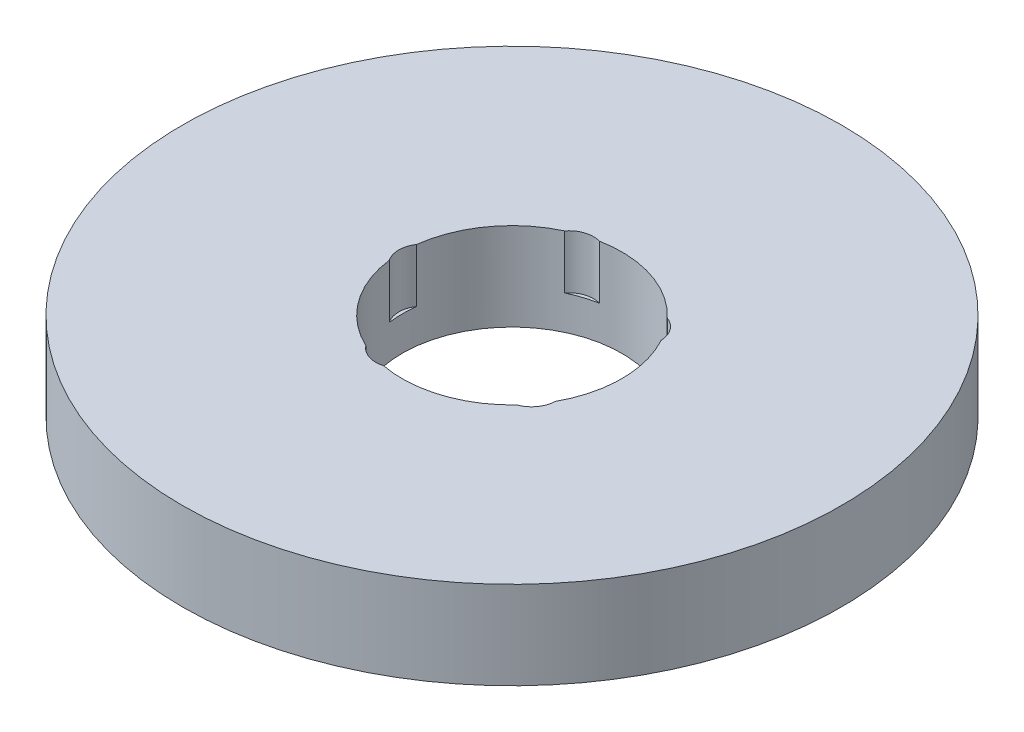
ISO-10303-21;
HEADER;
FILE_DESCRIPTION(('STEP AP214'),'2;1');
FILE_NAME('part.step','',(''),(''),'','','');
FILE_SCHEMA(('AUTOMOTIVE_DESIGN { 1 0 10303 214 1 1 1 1 }'));
ENDSEC;
DATA;
#1=APPLICATION_CONTEXT('core data for automotive mechanical design processes');
#2=APPLICATION_PROTOCOL_DEFINITION('international standard','automotive_design',2000,#1);
#3=PRODUCT_CONTEXT('',#1,'mechanical');
#4=PRODUCT('Part','Part','',(#3));
#5=PRODUCT_RELATED_PRODUCT_CATEGORY('part','',(#4));
#6=PRODUCT_DEFINITION_FORMATION('','',#4);
#7=PRODUCT_DEFINITION_CONTEXT('part definition',#1,'design');
#8=PRODUCT_DEFINITION('design','',#6,#7);
#9=PRODUCT_DEFINITION_SHAPE('','',#8);
#10=(LENGTH_UNIT() NAMED_UNIT(*) SI_UNIT(.MILLI.,.METRE.));
#11=(NAMED_UNIT(*) PLANE_ANGLE_UNIT() SI_UNIT($,.RADIAN.));
#12=(NAMED_UNIT(*) SI_UNIT($,.STERADIAN.) SOLID_ANGLE_UNIT());
#13=UNCERTAINTY_MEASURE_WITH_UNIT(LENGTH_MEASURE(1.E-05),#10,'distance_accuracy_value','');
#14=(GEOMETRIC_REPRESENTATION_CONTEXT(3) GLOBAL_UNCERTAINTY_ASSIGNED_CONTEXT((#13)) GLOBAL_UNIT_ASSIGNED_CONTEXT((#10,
#11,#12)) REPRESENTATION_CONTEXT('',''));
#15=CARTESIAN_POINT('',(0.,0.,0.));
#16=DIRECTION('',(0.,0.,1.));
#17=DIRECTION('',(1.,0.,0.));
#18=AXIS2_PLACEMENT_3D('',#15,#16,#17);
#19=CARTESIAN_POINT('',(0.,16.,0.));
#20=DIRECTION('',(0.,-1.,0.));
#21=DIRECTION('',(0.,0.,-1.));
#22=AXIS2_PLACEMENT_3D('',#19,#20,#21);
#23=CYLINDRICAL_SURFACE('',#22,60.);
#24=CARTESIAN_POINT('',(0.,16.,0.));
#25=DIRECTION('',(0.,1.,0.));
#26=DIRECTION('',(0.,0.,1.));
#27=AXIS2_PLACEMENT_3D('',#24,#25,#26);
#28=CIRCLE('',#27,60.);
#29=CARTESIAN_POINT('',(0.,16.,60.));
#30=VERTEX_POINT('',#29);
#31=EDGE_CURVE('E151',#30,#30,#28,.T.);
#32=ORIENTED_EDGE('',*,*,#31,.F.);
#33=EDGE_LOOP('',(#32));
#34=FACE_BOUND('',#33,.T.);
#35=CARTESIAN_POINT('',(0.,0.,0.));
#36=DIRECTION('',(0.,1.,0.));
#37=DIRECTION('',(0.,0.,1.));
#38=AXIS2_PLACEMENT_3D('',#35,#36,#37);
#39=CIRCLE('',#38,60.);
#40=CARTESIAN_POINT('',(0.,0.,60.));
#41=VERTEX_POINT('',#40);
#42=EDGE_CURVE('E150',#41,#41,#39,.T.);
#43=ORIENTED_EDGE('',*,*,#42,.T.);
#44=EDGE_LOOP('',(#43));
#45=FACE_BOUND('',#44,.T.);
#46=ADVANCED_FACE('F39',(#34,#45),#23,.T.);
#47=CARTESIAN_POINT('',(0.,16.,0.));
#48=DIRECTION('',(0.,1.,0.));
#49=DIRECTION('',(0.,0.,1.));
#50=AXIS2_PLACEMENT_3D('',#47,#48,#49);
#51=PLANE('',#50);
#52=CARTESIAN_POINT('',(-4.99429820584385,16.,-15.3708693678689));
#53=DIRECTION('',(0.,1.,0.));
#54=DIRECTION('',(-0.95105651629515,0.,0.309016994374958));
#55=AXIS2_PLACEMENT_3D('',#52,#53,#54);
#56=CIRCLE('',#55,4.45023562822626);
#57=CARTESIAN_POINT('',(-3.75348993247274,16.,-19.6446255583258));
#58=VERTEX_POINT('',#57);
#59=CARTESIAN_POINT('',(-8.51018404640637,16.,-18.0990819517535));
#60=VERTEX_POINT('',#59);
#61=EDGE_CURVE('E196',#58,#60,#56,.T.);
#62=ORIENTED_EDGE('',*,*,#61,.F.);
#63=CARTESIAN_POINT('',(0.,16.,0.));
#64=DIRECTION('',(0.,1.,0.));
#65=DIRECTION('',(0.,0.,1.));
#66=AXIS2_PLACEMENT_3D('',#63,#64,#65);
#67=CIRCLE('',#66,20.);
#68=CARTESIAN_POINT('',(14.5834583335771,16.,-13.6865898978825));
#69=VERTEX_POINT('',#68);
#70=EDGE_CURVE('E156',#69,#58,#67,.T.);
#71=ORIENTED_EDGE('',*,*,#70,.F.);
#72=CARTESIAN_POINT('',(13.0752424528513,16.,-9.49971970597775));
#73=DIRECTION('',(0.,1.,0.));
#74=DIRECTION('',(-0.58778525229248,0.,-0.809016994374942));
#75=AXIS2_PLACEMENT_3D('',#72,#73,#74);
#76=CIRCLE('',#75,4.45023562822626);
#77=CARTESIAN_POINT('',(17.5232569700747,16.,-9.64030420478151));
#78=VERTEX_POINT('',#77);
#79=EDGE_CURVE('E254',#78,#69,#76,.T.);
#80=ORIENTED_EDGE('',*,*,#79,.F.);
#81=CARTESIAN_POINT('',(17.5232569700749,16.,9.64030420478126));
#82=VERTEX_POINT('',#81);
#83=EDGE_CURVE('E153',#82,#78,#67,.T.);
#84=ORIENTED_EDGE('',*,*,#83,.F.);
#85=CARTESIAN_POINT('',(13.0752424528514,16.,9.49971970597756));
#86=DIRECTION('',(0.,1.,0.));
#87=DIRECTION('',(0.587785252292469,0.,-0.809016994374951));
#88=AXIS2_PLACEMENT_3D('',#85,#86,#87);
#89=CIRCLE('',#88,4.45023562822626);
#90=CARTESIAN_POINT('',(14.5834583335773,16.,13.6865898978823));
#91=VERTEX_POINT('',#90);
#92=EDGE_CURVE('E248',#91,#82,#89,.T.);
#93=ORIENTED_EDGE('',*,*,#92,.F.);
#94=CARTESIAN_POINT('',(-3.75348993247245,16.,19.6446255583258));
#95=VERTEX_POINT('',#94);
#96=EDGE_CURVE('E140',#95,#91,#67,.T.);
#97=ORIENTED_EDGE('',*,*,#96,.F.);
#98=CARTESIAN_POINT('',(-4.99429820584363,16.,15.370869367869));
#99=DIRECTION('',(0.,1.,0.));
#100=DIRECTION('',(0.951056516295155,0.,0.309016994374945));
#101=AXIS2_PLACEMENT_3D('',#98,#99,#100);
#102=CIRCLE('',#101,4.45023562822626);
#103=CARTESIAN_POINT('',(-8.51018404640611,16.,18.0990819517537));
#104=VERTEX_POINT('',#103);
#105=EDGE_CURVE('E117',#104,#95,#102,.T.);
#106=ORIENTED_EDGE('',*,*,#105,.F.);
#107=CARTESIAN_POINT('',(-19.8430413247734,16.,2.50074208652887));
#108=VERTEX_POINT('',#107);
#109=EDGE_CURVE('E133',#108,#104,#67,.T.);
#110=ORIENTED_EDGE('',*,*,#109,.F.);
#111=CARTESIAN_POINT('',(-16.1618884940154,16.,0.));
#112=DIRECTION('',(0.,1.,0.));
#113=DIRECTION('',(0.,0.,1.));
#114=AXIS2_PLACEMENT_3D('',#111,#112,#113);
#115=CIRCLE('',#114,4.45023562822626);
#116=CARTESIAN_POINT('',(-19.8430413247734,16.,-2.50074208652887));
#117=VERTEX_POINT('',#116);
#118=EDGE_CURVE('E170',#117,#108,#115,.T.);
#119=ORIENTED_EDGE('',*,*,#118,.F.);
#120=EDGE_CURVE('E149',#60,#117,#67,.T.);
#121=ORIENTED_EDGE('',*,*,#120,.F.);
#122=EDGE_LOOP('',(#62,#71,#80,#84,#93,#97,#106,#110,#119,#121));
#123=FACE_BOUND('',#122,.T.);
#124=ORIENTED_EDGE('',*,*,#31,.T.);
#125=EDGE_LOOP('',(#124));
#126=FACE_BOUND('',#125,.T.);
#127=ADVANCED_FACE('F131',(#123,#126),#51,.T.);
#128=CARTESIAN_POINT('',(0.,0.,0.));
#129=DIRECTION('',(0.,1.,0.));
#130=DIRECTION('',(0.,0.,1.));
#131=AXIS2_PLACEMENT_3D('',#128,#129,#130);
#132=PLANE('',#131);
#133=CARTESIAN_POINT('',(0.,0.,0.));
#134=DIRECTION('',(0.,1.,0.));
#135=DIRECTION('',(0.,0.,1.));
#136=AXIS2_PLACEMENT_3D('',#133,#134,#135);
#137=CIRCLE('',#136,20.);
#138=CARTESIAN_POINT('',(0.,0.,20.));
#139=VERTEX_POINT('',#138);
#140=EDGE_CURVE('E160',#139,#139,#137,.T.);
#141=ORIENTED_EDGE('',*,*,#140,.T.);
#142=EDGE_LOOP('',(#141));
#143=FACE_BOUND('',#142,.T.);
#144=ORIENTED_EDGE('',*,*,#42,.F.);
#145=EDGE_LOOP('',(#144));
#146=FACE_BOUND('',#145,.T.);
#147=ADVANCED_FACE('F212',(#143,#146),#132,.F.);
#148=CARTESIAN_POINT('',(0.,16.,0.));
#149=DIRECTION('',(0.,-1.,0.));
#150=DIRECTION('',(0.,0.,-1.));
#151=AXIS2_PLACEMENT_3D('',#148,#149,#150);
#152=CYLINDRICAL_SURFACE('',#151,20.);
#153=DIRECTION('',(0.,1.,0.));
#154=VECTOR('',#153,1.);
#155=CARTESIAN_POINT('',(-3.75348993247275,11.1062446865874,-19.6446255583258));
#156=LINE('',#155,#154);
#157=CARTESIAN_POINT('',(-3.75348993247274,6.21248937317483,-19.6446255583258));
#158=VERTEX_POINT('',#157);
#159=EDGE_CURVE('E11',#158,#58,#156,.T.);
#160=ORIENTED_EDGE('',*,*,#159,.F.);
#161=CARTESIAN_POINT('',(0.,6.21248937317483,0.));
#162=DIRECTION('',(0.,1.,0.));
#163=DIRECTION('',(0.,0.,1.));
#164=AXIS2_PLACEMENT_3D('',#161,#162,#163);
#165=CIRCLE('',#164,20.);
#166=CARTESIAN_POINT('',(-8.51018404640637,6.21248937317483,-18.0990819517535));
#167=VERTEX_POINT('',#166);
#168=EDGE_CURVE('E193',#158,#167,#165,.T.);
#169=ORIENTED_EDGE('',*,*,#168,.T.);
#170=DIRECTION('',(0.,1.,0.));
#171=VECTOR('',#170,1.);
#172=CARTESIAN_POINT('',(-8.51018404640636,11.1062446865874,-18.0990819517535));
#173=LINE('',#172,#171);
#174=EDGE_CURVE('E46',#60,#167,#173,.F.);
#175=ORIENTED_EDGE('',*,*,#174,.F.);
#176=ORIENTED_EDGE('',*,*,#120,.T.);
#177=DIRECTION('',(0.,1.,0.));
#178=VECTOR('',#177,1.);
#179=CARTESIAN_POINT('',(-19.8430413247734,11.1062446865874,-2.50074208652886));
#180=LINE('',#179,#178);
#181=CARTESIAN_POINT('',(-19.8430413247734,6.21248937317483,-2.50074208652887));
#182=VERTEX_POINT('',#181);
#183=EDGE_CURVE('E174',#182,#117,#180,.T.);
#184=ORIENTED_EDGE('',*,*,#183,.F.);
#185=CARTESIAN_POINT('',(0.,6.21248937317483,0.));
#186=DIRECTION('',(0.,1.,0.));
#187=DIRECTION('',(0.,0.,1.));
#188=AXIS2_PLACEMENT_3D('',#185,#186,#187);
#189=CIRCLE('',#188,20.);
#190=CARTESIAN_POINT('',(-19.8430413247734,6.21248937317483,2.50074208652887));
#191=VERTEX_POINT('',#190);
#192=EDGE_CURVE('E171',#182,#191,#189,.T.);
#193=ORIENTED_EDGE('',*,*,#192,.T.);
#194=DIRECTION('',(0.,1.,0.));
#195=VECTOR('',#194,1.);
#196=CARTESIAN_POINT('',(-19.8430413247734,11.1062446865874,2.50074208652886));
#197=LINE('',#196,#195);
#198=EDGE_CURVE('E148',#108,#191,#197,.F.);
#199=ORIENTED_EDGE('',*,*,#198,.F.);
#200=ORIENTED_EDGE('',*,*,#109,.T.);
#201=DIRECTION('',(0.,1.,0.));
#202=VECTOR('',#201,1.);
#203=CARTESIAN_POINT('',(-8.5101840464061,11.1062446865874,18.0990819517537));
#204=LINE('',#203,#202);
#205=CARTESIAN_POINT('',(-8.51018404640611,6.21248937317483,18.0990819517537));
#206=VERTEX_POINT('',#205);
#207=EDGE_CURVE('E111',#206,#104,#204,.T.);
#208=ORIENTED_EDGE('',*,*,#207,.F.);
#209=CARTESIAN_POINT('',(0.,6.21248937317483,0.));
#210=DIRECTION('',(0.,1.,0.));
#211=DIRECTION('',(0.,0.,1.));
#212=AXIS2_PLACEMENT_3D('',#209,#210,#211);
#213=CIRCLE('',#212,20.);
#214=CARTESIAN_POINT('',(-3.75348993247245,6.21248937317483,19.6446255583258));
#215=VERTEX_POINT('',#214);
#216=EDGE_CURVE('E180',#206,#215,#213,.T.);
#217=ORIENTED_EDGE('',*,*,#216,.T.);
#218=DIRECTION('',(0.,1.,0.));
#219=VECTOR('',#218,1.);
#220=CARTESIAN_POINT('',(-3.75348993247247,11.1062446865874,19.6446255583258));
#221=LINE('',#220,#219);
#222=EDGE_CURVE('E124',#95,#215,#221,.F.);
#223=ORIENTED_EDGE('',*,*,#222,.F.);
#224=ORIENTED_EDGE('',*,*,#96,.T.);
#225=DIRECTION('',(0.,1.,0.));
#226=VECTOR('',#225,1.);
#227=CARTESIAN_POINT('',(14.5834583335773,11.1062446865874,13.6865898978823));
#228=LINE('',#227,#226);
#229=CARTESIAN_POINT('',(14.5834583335773,6.21248937317483,13.6865898978823));
#230=VERTEX_POINT('',#229);
#231=EDGE_CURVE('E183',#230,#91,#228,.T.);
#232=ORIENTED_EDGE('',*,*,#231,.F.);
#233=CARTESIAN_POINT('',(0.,6.21248937317483,0.));
#234=DIRECTION('',(0.,1.,0.));
#235=DIRECTION('',(0.,0.,1.));
#236=AXIS2_PLACEMENT_3D('',#233,#234,#235);
#237=CIRCLE('',#236,20.);
#238=CARTESIAN_POINT('',(17.5232569700749,6.21248937317483,9.64030420478126));
#239=VERTEX_POINT('',#238);
#240=EDGE_CURVE('E123',#230,#239,#237,.T.);
#241=ORIENTED_EDGE('',*,*,#240,.T.);
#242=DIRECTION('',(0.,1.,0.));
#243=VECTOR('',#242,1.);
#244=CARTESIAN_POINT('',(17.5232569700749,11.1062446865874,9.64030420478127));
#245=LINE('',#244,#243);
#246=EDGE_CURVE('E185',#82,#239,#245,.F.);
#247=ORIENTED_EDGE('',*,*,#246,.F.);
#248=ORIENTED_EDGE('',*,*,#83,.T.);
#249=DIRECTION('',(0.,1.,0.));
#250=VECTOR('',#249,1.);
#251=CARTESIAN_POINT('',(17.5232569700747,11.1062446865874,-9.64030420478152));
#252=LINE('',#251,#250);
#253=CARTESIAN_POINT('',(17.5232569700747,6.21248937317483,-9.64030420478151));
#254=VERTEX_POINT('',#253);
#255=EDGE_CURVE('E195',#254,#78,#252,.T.);
#256=ORIENTED_EDGE('',*,*,#255,.F.);
#257=CARTESIAN_POINT('',(0.,6.21248937317483,0.));
#258=DIRECTION('',(0.,1.,0.));
#259=DIRECTION('',(0.,0.,1.));
#260=AXIS2_PLACEMENT_3D('',#257,#258,#259);
#261=CIRCLE('',#260,20.);
#262=CARTESIAN_POINT('',(14.5834583335771,6.21248937317483,-13.6865898978825));
#263=VERTEX_POINT('',#262);
#264=EDGE_CURVE('E190',#254,#263,#261,.T.);
#265=ORIENTED_EDGE('',*,*,#264,.T.);
#266=DIRECTION('',(0.,1.,0.));
#267=VECTOR('',#266,1.);
#268=CARTESIAN_POINT('',(14.5834583335771,11.1062446865874,-13.6865898978825));
#269=LINE('',#268,#267);
#270=EDGE_CURVE('E189',#69,#263,#269,.F.);
#271=ORIENTED_EDGE('',*,*,#270,.F.);
#272=ORIENTED_EDGE('',*,*,#70,.T.);
#273=EDGE_LOOP('',(#160,#169,#175,#176,#184,#193,#199,#200,#208,#217,#223,#224,#232,#241,#247,
#248,#256,#265,#271,#272));
#274=FACE_BOUND('',#273,.T.);
#275=ORIENTED_EDGE('',*,*,#140,.F.);
#276=EDGE_LOOP('',(#275));
#277=FACE_BOUND('',#276,.T.);
#278=ADVANCED_FACE('F142',(#274,#277),#152,.F.);
#279=CARTESIAN_POINT('',(-16.1618884940154,6.21248937317483,0.));
#280=DIRECTION('',(0.,1.,0.));
#281=DIRECTION('',(0.,0.,1.));
#282=AXIS2_PLACEMENT_3D('',#279,#280,#281);
#283=CYLINDRICAL_SURFACE('',#282,4.45023562822626);
#284=ORIENTED_EDGE('',*,*,#183,.T.);
#285=ORIENTED_EDGE('',*,*,#118,.T.);
#286=ORIENTED_EDGE('',*,*,#198,.T.);
#287=CARTESIAN_POINT('',(-16.1618884940154,6.21248937317483,0.));
#288=DIRECTION('',(0.,1.,0.));
#289=DIRECTION('',(0.,0.,1.));
#290=AXIS2_PLACEMENT_3D('',#287,#288,#289);
#291=CIRCLE('',#290,4.45023562822626);
#292=EDGE_CURVE('E163',#182,#191,#291,.T.);
#293=ORIENTED_EDGE('',*,*,#292,.F.);
#294=EDGE_LOOP('',(#284,#285,#286,#293));
#295=FACE_BOUND('',#294,.T.);
#296=ADVANCED_FACE('F221',(#295),#283,.F.);
#297=CARTESIAN_POINT('',(-16.1618884940154,6.21248937317483,0.));
#298=DIRECTION('',(0.,1.,0.));
#299=DIRECTION('',(0.,0.,1.));
#300=AXIS2_PLACEMENT_3D('',#297,#298,#299);
#301=PLANE('',#300);
#302=ORIENTED_EDGE('',*,*,#292,.T.);
#303=ORIENTED_EDGE('',*,*,#192,.F.);
#304=EDGE_LOOP('',(#302,#303));
#305=FACE_BOUND('',#304,.T.);
#306=ADVANCED_FACE('F227',(#305),#301,.T.);
#307=CARTESIAN_POINT('',(-4.99429820584363,6.21248937317483,15.370869367869));
#308=DIRECTION('',(0.,1.,0.));
#309=DIRECTION('',(0.,0.,1.));
#310=AXIS2_PLACEMENT_3D('',#307,#308,#309);
#311=CYLINDRICAL_SURFACE('',#310,4.45023562822626);
#312=ORIENTED_EDGE('',*,*,#207,.T.);
#313=ORIENTED_EDGE('',*,*,#105,.T.);
#314=ORIENTED_EDGE('',*,*,#222,.T.);
#315=CARTESIAN_POINT('',(-4.99429820584363,6.21248937317483,15.370869367869));
#316=DIRECTION('',(0.,1.,0.));
#317=DIRECTION('',(0.951056516295155,0.,0.309016994374945));
#318=AXIS2_PLACEMENT_3D('',#315,#316,#317);
#319=CIRCLE('',#318,4.45023562822626);
#320=EDGE_CURVE('E119',#206,#215,#319,.T.);
#321=ORIENTED_EDGE('',*,*,#320,.F.);
#322=EDGE_LOOP('',(#312,#313,#314,#321));
#323=FACE_BOUND('',#322,.T.);
#324=ADVANCED_FACE('F116',(#323),#311,.F.);
#325=CARTESIAN_POINT('',(-4.99429820584363,6.21248937317483,15.370869367869));
#326=DIRECTION('',(0.,1.,0.));
#327=DIRECTION('',(0.951056516295155,0.,0.309016994374945));
#328=AXIS2_PLACEMENT_3D('',#325,#326,#327);
#329=PLANE('',#328);
#330=ORIENTED_EDGE('',*,*,#320,.T.);
#331=ORIENTED_EDGE('',*,*,#216,.F.);
#332=EDGE_LOOP('',(#330,#331));
#333=FACE_BOUND('',#332,.T.);
#334=ADVANCED_FACE('F234',(#333),#329,.T.);
#335=CARTESIAN_POINT('',(13.0752424528514,6.21248937317483,9.49971970597756));
#336=DIRECTION('',(0.,1.,0.));
#337=DIRECTION('',(0.,0.,1.));
#338=AXIS2_PLACEMENT_3D('',#335,#336,#337);
#339=CYLINDRICAL_SURFACE('',#338,4.45023562822626);
#340=ORIENTED_EDGE('',*,*,#231,.T.);
#341=ORIENTED_EDGE('',*,*,#92,.T.);
#342=ORIENTED_EDGE('',*,*,#246,.T.);
#343=CARTESIAN_POINT('',(13.0752424528514,6.21248937317483,9.49971970597756));
#344=DIRECTION('',(0.,1.,0.));
#345=DIRECTION('',(0.587785252292469,0.,-0.809016994374951));
#346=AXIS2_PLACEMENT_3D('',#343,#344,#345);
#347=CIRCLE('',#346,4.45023562822626);
#348=EDGE_CURVE('E137',#230,#239,#347,.T.);
#349=ORIENTED_EDGE('',*,*,#348,.F.);
#350=EDGE_LOOP('',(#340,#341,#342,#349));
#351=FACE_BOUND('',#350,.T.);
#352=ADVANCED_FACE('F240',(#351),#339,.F.);
#353=CARTESIAN_POINT('',(13.0752424528514,6.21248937317483,9.49971970597756));
#354=DIRECTION('',(0.,1.,0.));
#355=DIRECTION('',(0.587785252292469,0.,-0.809016994374951));
#356=AXIS2_PLACEMENT_3D('',#353,#354,#355);
#357=PLANE('',#356);
#358=ORIENTED_EDGE('',*,*,#348,.T.);
#359=ORIENTED_EDGE('',*,*,#240,.F.);
#360=EDGE_LOOP('',(#358,#359));
#361=FACE_BOUND('',#360,.T.);
#362=ADVANCED_FACE('F245',(#361),#357,.T.);
#363=CARTESIAN_POINT('',(13.0752424528513,6.21248937317483,-9.49971970597775));
#364=DIRECTION('',(0.,1.,0.));
#365=DIRECTION('',(0.,0.,1.));
#366=AXIS2_PLACEMENT_3D('',#363,#364,#365);
#367=CYLINDRICAL_SURFACE('',#366,4.45023562822626);
#368=ORIENTED_EDGE('',*,*,#255,.T.);
#369=ORIENTED_EDGE('',*,*,#79,.T.);
#370=ORIENTED_EDGE('',*,*,#270,.T.);
#371=CARTESIAN_POINT('',(13.0752424528513,6.21248937317483,-9.49971970597775));
#372=DIRECTION('',(0.,1.,0.));
#373=DIRECTION('',(-0.58778525229248,0.,-0.809016994374942));
#374=AXIS2_PLACEMENT_3D('',#371,#372,#373);
#375=CIRCLE('',#374,4.45023562822626);
#376=EDGE_CURVE('E56',#254,#263,#375,.T.);
#377=ORIENTED_EDGE('',*,*,#376,.F.);
#378=EDGE_LOOP('',(#368,#369,#370,#377));
#379=FACE_BOUND('',#378,.T.);
#380=ADVANCED_FACE('F264',(#379),#367,.F.);
#381=CARTESIAN_POINT('',(13.0752424528513,6.21248937317483,-9.49971970597775));
#382=DIRECTION('',(0.,1.,0.));
#383=DIRECTION('',(-0.58778525229248,0.,-0.809016994374942));
#384=AXIS2_PLACEMENT_3D('',#381,#382,#383);
#385=PLANE('',#384);
#386=ORIENTED_EDGE('',*,*,#376,.T.);
#387=ORIENTED_EDGE('',*,*,#264,.F.);
#388=EDGE_LOOP('',(#386,#387));
#389=FACE_BOUND('',#388,.T.);
#390=ADVANCED_FACE('F202',(#389),#385,.T.);
#391=CARTESIAN_POINT('',(-4.99429820584385,6.21248937317483,-15.3708693678689));
#392=DIRECTION('',(0.,1.,0.));
#393=DIRECTION('',(0.,0.,1.));
#394=AXIS2_PLACEMENT_3D('',#391,#392,#393);
#395=CYLINDRICAL_SURFACE('',#394,4.45023562822626);
#396=ORIENTED_EDGE('',*,*,#159,.T.);
#397=ORIENTED_EDGE('',*,*,#61,.T.);
#398=ORIENTED_EDGE('',*,*,#174,.T.);
#399=CARTESIAN_POINT('',(-4.99429820584385,6.21248937317483,-15.3708693678689));
#400=DIRECTION('',(0.,1.,0.));
#401=DIRECTION('',(-0.95105651629515,0.,0.309016994374958));
#402=AXIS2_PLACEMENT_3D('',#399,#400,#401);
#403=CIRCLE('',#402,4.45023562822626);
#404=EDGE_CURVE('E55',#158,#167,#403,.T.);
#405=ORIENTED_EDGE('',*,*,#404,.F.);
#406=EDGE_LOOP('',(#396,#397,#398,#405));
#407=FACE_BOUND('',#406,.T.);
#408=ADVANCED_FACE('F197',(#407),#395,.F.);
#409=CARTESIAN_POINT('',(-4.99429820584385,6.21248937317483,-15.3708693678689));
#410=DIRECTION('',(0.,1.,0.));
#411=DIRECTION('',(-0.95105651629515,0.,0.309016994374958));
#412=AXIS2_PLACEMENT_3D('',#409,#410,#411);
#413=PLANE('',#412);
#414=ORIENTED_EDGE('',*,*,#404,.T.);
#415=ORIENTED_EDGE('',*,*,#168,.F.);
#416=EDGE_LOOP('',(#414,#415));
#417=FACE_BOUND('',#416,.T.);
#418=ADVANCED_FACE('F200',(#417),#413,.T.);
#419=CLOSED_SHELL('',(#46,#127,#147,#278,#296,#306,#324,#334,#352,#362,#380,#390,#408,#418));
#420=MANIFOLD_SOLID_BREP('B2',#419);
#421=ADVANCED_BREP_SHAPE_REPRESENTATION('',(#18,#420),#14);
#422=SHAPE_DEFINITION_REPRESENTATION(#9,#421);
ENDSEC;
END-ISO-10303-21;
